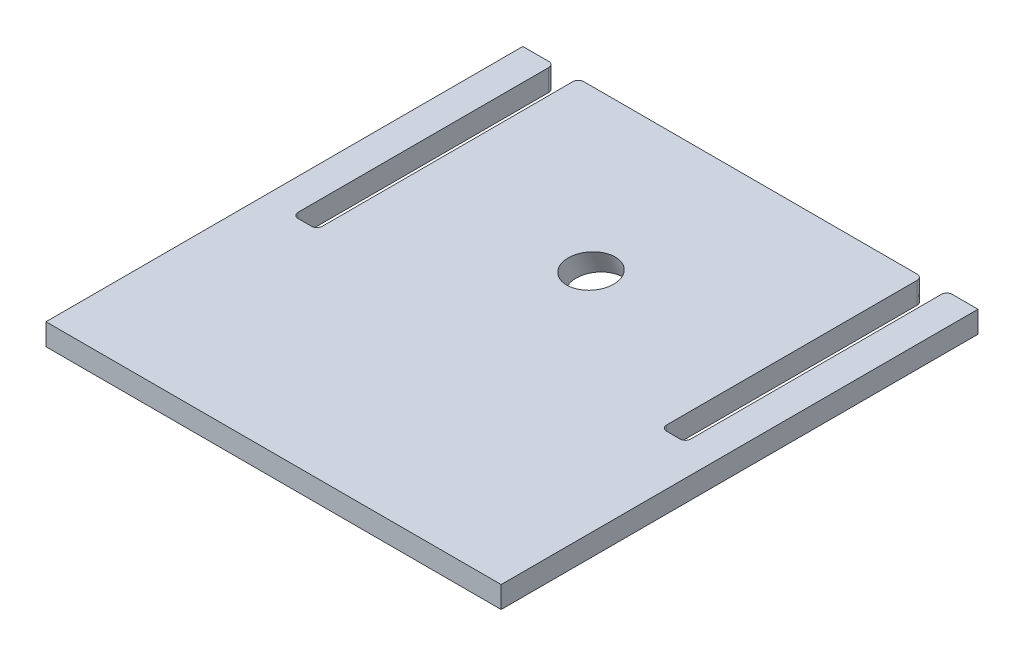
ISO-10303-21;
HEADER;
FILE_DESCRIPTION(('STEP AP214'),'2;1');
FILE_NAME('part.step','',(''),(''),'','','');
FILE_SCHEMA(('AUTOMOTIVE_DESIGN { 1 0 10303 214 1 1 1 1 }'));
ENDSEC;
DATA;
#1=APPLICATION_CONTEXT('core data for automotive mechanical design processes');
#2=APPLICATION_PROTOCOL_DEFINITION('international standard','automotive_design',2000,#1);
#3=PRODUCT_CONTEXT('',#1,'mechanical');
#4=PRODUCT('Part','Part','',(#3));
#5=PRODUCT_RELATED_PRODUCT_CATEGORY('part','',(#4));
#6=PRODUCT_DEFINITION_FORMATION('','',#4);
#7=PRODUCT_DEFINITION_CONTEXT('part definition',#1,'design');
#8=PRODUCT_DEFINITION('design','',#6,#7);
#9=PRODUCT_DEFINITION_SHAPE('','',#8);
#10=(LENGTH_UNIT() NAMED_UNIT(*) SI_UNIT(.MILLI.,.METRE.));
#11=(NAMED_UNIT(*) PLANE_ANGLE_UNIT() SI_UNIT($,.RADIAN.));
#12=(NAMED_UNIT(*) SI_UNIT($,.STERADIAN.) SOLID_ANGLE_UNIT());
#13=UNCERTAINTY_MEASURE_WITH_UNIT(LENGTH_MEASURE(1.E-05),#10,'distance_accuracy_value','');
#14=(GEOMETRIC_REPRESENTATION_CONTEXT(3) GLOBAL_UNCERTAINTY_ASSIGNED_CONTEXT((#13)) GLOBAL_UNIT_ASSIGNED_CONTEXT((#10,
#11,#12)) REPRESENTATION_CONTEXT('',''));
#15=CARTESIAN_POINT('',(0.,0.,0.));
#16=DIRECTION('',(0.,0.,1.));
#17=DIRECTION('',(1.,0.,0.));
#18=AXIS2_PLACEMENT_3D('',#15,#16,#17);
#19=CARTESIAN_POINT('',(-165.1,6.35,-139.7));
#20=DIRECTION('',(0.,0.,1.));
#21=DIRECTION('',(1.,0.,0.));
#22=AXIS2_PLACEMENT_3D('',#19,#20,#21);
#23=PLANE('',#22);
#24=DIRECTION('',(-1.,0.,0.));
#25=VECTOR('',#24,1.);
#26=CARTESIAN_POINT('',(-165.1,6.35,-139.7));
#27=LINE('',#26,#25);
#28=CARTESIAN_POINT('',(-118.237,6.35,-139.7));
#29=VERTEX_POINT('',#28);
#30=CARTESIAN_POINT('',(-133.35,6.35,-139.7));
#31=VERTEX_POINT('',#30);
#32=EDGE_CURVE('E408',#29,#31,#27,.T.);
#33=ORIENTED_EDGE('',*,*,#32,.F.);
#34=DIRECTION('',(0.,1.,0.));
#35=VECTOR('',#34,1.);
#36=CARTESIAN_POINT('',(-118.237,6.35,-139.7));
#37=LINE('',#36,#35);
#38=CARTESIAN_POINT('',(-118.237,-6.35,-139.7));
#39=VERTEX_POINT('',#38);
#40=EDGE_CURVE('E190',#29,#39,#37,.F.);
#41=ORIENTED_EDGE('',*,*,#40,.T.);
#42=DIRECTION('',(-1.,0.,0.));
#43=VECTOR('',#42,1.);
#44=CARTESIAN_POINT('',(-165.1,-6.35,-139.7));
#45=LINE('',#44,#43);
#46=CARTESIAN_POINT('',(-133.35,-6.35,-139.7));
#47=VERTEX_POINT('',#46);
#48=EDGE_CURVE('E185',#39,#47,#45,.T.);
#49=ORIENTED_EDGE('',*,*,#48,.T.);
#50=DIRECTION('',(0.,1.,0.));
#51=VECTOR('',#50,1.);
#52=CARTESIAN_POINT('',(-133.35,-6.35,-139.7));
#53=LINE('',#52,#51);
#54=EDGE_CURVE('E188',#47,#31,#53,.T.);
#55=ORIENTED_EDGE('',*,*,#54,.T.);
#56=EDGE_LOOP('',(#33,#41,#49,#55));
#57=FACE_BOUND('',#56,.T.);
#58=ADVANCED_FACE('F45',(#57),#23,.F.);
#59=CARTESIAN_POINT('',(133.35,-6.35,-139.7));
#60=VERTEX_POINT('',#59);
#61=CARTESIAN_POINT('',(118.237,-6.35,-139.7));
#62=VERTEX_POINT('',#61);
#63=EDGE_CURVE('E195',#60,#62,#45,.T.);
#64=ORIENTED_EDGE('',*,*,#63,.T.);
#65=DIRECTION('',(0.,1.,0.));
#66=VECTOR('',#65,1.);
#67=CARTESIAN_POINT('',(118.237,6.35,-139.7));
#68=LINE('',#67,#66);
#69=CARTESIAN_POINT('',(118.237,6.35,-139.7));
#70=VERTEX_POINT('',#69);
#71=EDGE_CURVE('E326',#62,#70,#68,.T.);
#72=ORIENTED_EDGE('',*,*,#71,.T.);
#73=CARTESIAN_POINT('',(133.35,6.35,-139.7));
#74=VERTEX_POINT('',#73);
#75=EDGE_CURVE('E407',#74,#70,#27,.T.);
#76=ORIENTED_EDGE('',*,*,#75,.F.);
#77=DIRECTION('',(0.,1.,0.));
#78=VECTOR('',#77,1.);
#79=CARTESIAN_POINT('',(133.35,-6.35,-139.7));
#80=LINE('',#79,#78);
#81=EDGE_CURVE('E416',#60,#74,#80,.T.);
#82=ORIENTED_EDGE('',*,*,#81,.F.);
#83=EDGE_LOOP('',(#64,#72,#76,#82));
#84=FACE_BOUND('',#83,.T.);
#85=ADVANCED_FACE('F433',(#84),#23,.F.);
#86=CARTESIAN_POINT('',(97.663,-6.35,-139.7));
#87=VERTEX_POINT('',#86);
#88=CARTESIAN_POINT('',(-97.663,-6.35,-139.7));
#89=VERTEX_POINT('',#88);
#90=EDGE_CURVE('E196',#87,#89,#45,.T.);
#91=ORIENTED_EDGE('',*,*,#90,.T.);
#92=DIRECTION('',(0.,1.,0.));
#93=VECTOR('',#92,1.);
#94=CARTESIAN_POINT('',(-97.663,6.35,-139.7));
#95=LINE('',#94,#93);
#96=CARTESIAN_POINT('',(-97.663,6.35,-139.7));
#97=VERTEX_POINT('',#96);
#98=EDGE_CURVE('E308',#89,#97,#95,.T.);
#99=ORIENTED_EDGE('',*,*,#98,.T.);
#100=CARTESIAN_POINT('',(97.663,6.35,-139.7));
#101=VERTEX_POINT('',#100);
#102=EDGE_CURVE('E221',#101,#97,#27,.T.);
#103=ORIENTED_EDGE('',*,*,#102,.F.);
#104=DIRECTION('',(0.,1.,0.));
#105=VECTOR('',#104,1.);
#106=CARTESIAN_POINT('',(97.663,6.35,-139.7));
#107=LINE('',#106,#105);
#108=EDGE_CURVE('E305',#101,#87,#107,.F.);
#109=ORIENTED_EDGE('',*,*,#108,.T.);
#110=EDGE_LOOP('',(#91,#99,#103,#109));
#111=FACE_BOUND('',#110,.T.);
#112=ADVANCED_FACE('F393',(#111),#23,.F.);
#113=CARTESIAN_POINT('',(-165.1,6.35,139.7));
#114=DIRECTION('',(0.,0.,-1.));
#115=DIRECTION('',(-1.,0.,0.));
#116=AXIS2_PLACEMENT_3D('',#113,#114,#115);
#117=PLANE('',#116);
#118=DIRECTION('',(1.,0.,0.));
#119=VECTOR('',#118,1.);
#120=CARTESIAN_POINT('',(-165.1,6.35,139.7));
#121=LINE('',#120,#119);
#122=CARTESIAN_POINT('',(-133.35,6.35,139.7));
#123=VERTEX_POINT('',#122);
#124=CARTESIAN_POINT('',(133.35,6.35,139.7));
#125=VERTEX_POINT('',#124);
#126=EDGE_CURVE('E403',#123,#125,#121,.T.);
#127=ORIENTED_EDGE('',*,*,#126,.F.);
#128=DIRECTION('',(0.,1.,0.));
#129=VECTOR('',#128,1.);
#130=CARTESIAN_POINT('',(-133.35,-6.35,139.7));
#131=LINE('',#130,#129);
#132=CARTESIAN_POINT('',(-133.35,-6.35,139.7));
#133=VERTEX_POINT('',#132);
#134=EDGE_CURVE('E273',#133,#123,#131,.T.);
#135=ORIENTED_EDGE('',*,*,#134,.F.);
#136=DIRECTION('',(1.,0.,0.));
#137=VECTOR('',#136,1.);
#138=CARTESIAN_POINT('',(-165.1,-6.35,139.7));
#139=LINE('',#138,#137);
#140=CARTESIAN_POINT('',(133.35,-6.35,139.7));
#141=VERTEX_POINT('',#140);
#142=EDGE_CURVE('E210',#133,#141,#139,.T.);
#143=ORIENTED_EDGE('',*,*,#142,.T.);
#144=DIRECTION('',(0.,1.,0.));
#145=VECTOR('',#144,1.);
#146=CARTESIAN_POINT('',(133.35,-6.35,139.7));
#147=LINE('',#146,#145);
#148=EDGE_CURVE('E400',#141,#125,#147,.T.);
#149=ORIENTED_EDGE('',*,*,#148,.T.);
#150=EDGE_LOOP('',(#127,#135,#143,#149));
#151=FACE_BOUND('',#150,.T.);
#152=ADVANCED_FACE('F427',(#151),#117,.F.);
#153=CARTESIAN_POINT('',(0.,6.35,0.));
#154=DIRECTION('',(0.,-1.,0.));
#155=DIRECTION('',(0.,0.,-1.));
#156=AXIS2_PLACEMENT_3D('',#153,#154,#155);
#157=PLANE('',#156);
#158=CARTESIAN_POINT('',(0.577885440567185,6.35,-45.6972730911315));
#159=DIRECTION('',(0.,-1.,0.));
#160=DIRECTION('',(-0.0211224465515139,0.,-0.999776896238195));
#161=AXIS2_PLACEMENT_3D('',#158,#159,#160);
#162=ELLIPSE('',#161,14.2470282966305,13.335);
#163=CARTESIAN_POINT('',(0.2769533468537,6.35,-59.9411228221545));
#164=VERTEX_POINT('',#163);
#165=EDGE_CURVE('E268',#164,#164,#162,.F.);
#166=ORIENTED_EDGE('',*,*,#165,.F.);
#167=EDGE_LOOP('',(#166));
#168=FACE_BOUND('',#167,.T.);
#169=DIRECTION('',(0.,0.,1.));
#170=VECTOR('',#169,1.);
#171=CARTESIAN_POINT('',(-115.062,6.35,-139.7));
#172=LINE('',#171,#170);
#173=CARTESIAN_POINT('',(-115.062,6.35,-136.525));
#174=VERTEX_POINT('',#173);
#175=CARTESIAN_POINT('',(-115.062,6.35,10.287));
#176=VERTEX_POINT('',#175);
#177=EDGE_CURVE('E231',#174,#176,#172,.T.);
#178=ORIENTED_EDGE('',*,*,#177,.F.);
#179=CARTESIAN_POINT('',(-118.237,6.35,-136.525));
#180=DIRECTION('',(0.,-1.,0.));
#181=DIRECTION('',(0.,0.,-1.));
#182=AXIS2_PLACEMENT_3D('',#179,#180,#181);
#183=CIRCLE('',#182,3.175);
#184=EDGE_CURVE('E289',#174,#29,#183,.F.);
#185=ORIENTED_EDGE('',*,*,#184,.T.);
#186=ORIENTED_EDGE('',*,*,#32,.T.);
#187=DIRECTION('',(0.,0.,-1.));
#188=VECTOR('',#187,1.);
#189=CARTESIAN_POINT('',(-133.35,6.35,-139.7));
#190=LINE('',#189,#188);
#191=EDGE_CURVE('E203',#123,#31,#190,.T.);
#192=ORIENTED_EDGE('',*,*,#191,.F.);
#193=ORIENTED_EDGE('',*,*,#126,.T.);
#194=DIRECTION('',(0.,0.,1.));
#195=VECTOR('',#194,1.);
#196=CARTESIAN_POINT('',(133.35,6.35,-139.7));
#197=LINE('',#196,#195);
#198=EDGE_CURVE('E229',#74,#125,#197,.T.);
#199=ORIENTED_EDGE('',*,*,#198,.F.);
#200=ORIENTED_EDGE('',*,*,#75,.T.);
#201=CARTESIAN_POINT('',(118.237,6.35,-136.525));
#202=DIRECTION('',(0.,-1.,0.));
#203=DIRECTION('',(0.,0.,-1.));
#204=AXIS2_PLACEMENT_3D('',#201,#202,#203);
#205=CIRCLE('',#204,3.175);
#206=CARTESIAN_POINT('',(115.062,6.35,-136.525));
#207=VERTEX_POINT('',#206);
#208=EDGE_CURVE('E280',#70,#207,#205,.F.);
#209=ORIENTED_EDGE('',*,*,#208,.T.);
#210=DIRECTION('',(0.,0.,-1.));
#211=VECTOR('',#210,1.);
#212=CARTESIAN_POINT('',(115.062,6.35,-139.7));
#213=LINE('',#212,#211);
#214=CARTESIAN_POINT('',(115.062,6.35,10.287));
#215=VERTEX_POINT('',#214);
#216=EDGE_CURVE('E251',#215,#207,#213,.T.);
#217=ORIENTED_EDGE('',*,*,#216,.F.);
#218=CARTESIAN_POINT('',(111.887,6.35,10.287));
#219=DIRECTION('',(0.,-1.,0.));
#220=DIRECTION('',(0.,0.,-1.));
#221=AXIS2_PLACEMENT_3D('',#218,#219,#220);
#222=CIRCLE('',#221,3.175);
#223=CARTESIAN_POINT('',(111.887,6.35,13.462));
#224=VERTEX_POINT('',#223);
#225=EDGE_CURVE('E362',#215,#224,#222,.T.);
#226=ORIENTED_EDGE('',*,*,#225,.T.);
#227=DIRECTION('',(1.,0.,0.));
#228=VECTOR('',#227,1.);
#229=CARTESIAN_POINT('',(114.3,6.35,13.462));
#230=LINE('',#229,#228);
#231=CARTESIAN_POINT('',(104.013,6.35,13.462));
#232=VERTEX_POINT('',#231);
#233=EDGE_CURVE('E247',#232,#224,#230,.T.);
#234=ORIENTED_EDGE('',*,*,#233,.F.);
#235=CARTESIAN_POINT('',(104.013,6.35,10.287));
#236=DIRECTION('',(0.,-1.,0.));
#237=DIRECTION('',(0.,0.,-1.));
#238=AXIS2_PLACEMENT_3D('',#235,#236,#237);
#239=CIRCLE('',#238,3.175);
#240=CARTESIAN_POINT('',(100.838,6.35,10.287));
#241=VERTEX_POINT('',#240);
#242=EDGE_CURVE('E350',#232,#241,#239,.T.);
#243=ORIENTED_EDGE('',*,*,#242,.T.);
#244=DIRECTION('',(0.,0.,1.));
#245=VECTOR('',#244,1.);
#246=CARTESIAN_POINT('',(100.838,6.35,-139.7));
#247=LINE('',#246,#245);
#248=CARTESIAN_POINT('',(100.838,6.35,-136.525));
#249=VERTEX_POINT('',#248);
#250=EDGE_CURVE('E234',#249,#241,#247,.T.);
#251=ORIENTED_EDGE('',*,*,#250,.F.);
#252=CARTESIAN_POINT('',(97.663,6.35,-136.525));
#253=DIRECTION('',(0.,-1.,0.));
#254=DIRECTION('',(0.,0.,-1.));
#255=AXIS2_PLACEMENT_3D('',#252,#253,#254);
#256=CIRCLE('',#255,3.175);
#257=EDGE_CURVE('E283',#249,#101,#256,.F.);
#258=ORIENTED_EDGE('',*,*,#257,.T.);
#259=ORIENTED_EDGE('',*,*,#102,.T.);
#260=CARTESIAN_POINT('',(-97.663,6.35,-136.525));
#261=DIRECTION('',(0.,-1.,0.));
#262=DIRECTION('',(0.,0.,-1.));
#263=AXIS2_PLACEMENT_3D('',#260,#261,#262);
#264=CIRCLE('',#263,3.175);
#265=CARTESIAN_POINT('',(-100.838,6.35,-136.525));
#266=VERTEX_POINT('',#265);
#267=EDGE_CURVE('E286',#97,#266,#264,.F.);
#268=ORIENTED_EDGE('',*,*,#267,.T.);
#269=DIRECTION('',(0.,0.,-1.));
#270=VECTOR('',#269,1.);
#271=CARTESIAN_POINT('',(-100.838,6.35,-139.7));
#272=LINE('',#271,#270);
#273=CARTESIAN_POINT('',(-100.838,6.35,10.287));
#274=VERTEX_POINT('',#273);
#275=EDGE_CURVE('E230',#274,#266,#272,.T.);
#276=ORIENTED_EDGE('',*,*,#275,.F.);
#277=CARTESIAN_POINT('',(-104.013,6.35,10.287));
#278=DIRECTION('',(0.,-1.,0.));
#279=DIRECTION('',(0.,0.,-1.));
#280=AXIS2_PLACEMENT_3D('',#277,#278,#279);
#281=CIRCLE('',#280,3.175);
#282=CARTESIAN_POINT('',(-104.013,6.35,13.462));
#283=VERTEX_POINT('',#282);
#284=EDGE_CURVE('E54',#274,#283,#281,.T.);
#285=ORIENTED_EDGE('',*,*,#284,.T.);
#286=DIRECTION('',(1.,0.,0.));
#287=VECTOR('',#286,1.);
#288=CARTESIAN_POINT('',(-114.3,6.35,13.462));
#289=LINE('',#288,#287);
#290=CARTESIAN_POINT('',(-111.887,6.35,13.462));
#291=VERTEX_POINT('',#290);
#292=EDGE_CURVE('E225',#291,#283,#289,.T.);
#293=ORIENTED_EDGE('',*,*,#292,.F.);
#294=CARTESIAN_POINT('',(-111.887,6.35,10.287));
#295=DIRECTION('',(0.,-1.,0.));
#296=DIRECTION('',(0.,0.,-1.));
#297=AXIS2_PLACEMENT_3D('',#294,#295,#296);
#298=CIRCLE('',#297,3.175);
#299=EDGE_CURVE('E356',#291,#176,#298,.T.);
#300=ORIENTED_EDGE('',*,*,#299,.T.);
#301=EDGE_LOOP('',(#178,#185,#186,#192,#193,#199,#200,#209,#217,#226,#234,#243,#251,#258,#259,
#268,#276,#285,#293,#300));
#302=FACE_BOUND('',#301,.T.);
#303=ADVANCED_FACE('F372',(#168,#302),#157,.F.);
#304=CARTESIAN_POINT('',(0.,-6.35,0.));
#305=DIRECTION('',(0.,-1.,0.));
#306=DIRECTION('',(0.,0.,-1.));
#307=AXIS2_PLACEMENT_3D('',#304,#305,#306);
#308=PLANE('',#307);
#309=CARTESIAN_POINT('',(0.476989852232747,-6.35,-50.4729072916073));
#310=DIRECTION('',(0.,-1.,0.));
#311=DIRECTION('',(-0.0211224465515139,0.,-0.999776896238195));
#312=AXIS2_PLACEMENT_3D('',#309,#310,#311);
#313=ELLIPSE('',#312,14.2470282966305,13.335);
#314=CARTESIAN_POINT('',(0.176057758519262,-6.35,-64.7167570226303));
#315=VERTEX_POINT('',#314);
#316=EDGE_CURVE('E213',#315,#315,#313,.F.);
#317=ORIENTED_EDGE('',*,*,#316,.T.);
#318=EDGE_LOOP('',(#317));
#319=FACE_BOUND('',#318,.T.);
#320=ORIENTED_EDGE('',*,*,#48,.F.);
#321=CARTESIAN_POINT('',(-118.237,-6.35,-136.525));
#322=DIRECTION('',(0.,-1.,0.));
#323=DIRECTION('',(0.,0.,-1.));
#324=AXIS2_PLACEMENT_3D('',#321,#322,#323);
#325=CIRCLE('',#324,3.175);
#326=CARTESIAN_POINT('',(-115.062,-6.35,-136.525));
#327=VERTEX_POINT('',#326);
#328=EDGE_CURVE('E302',#39,#327,#325,.T.);
#329=ORIENTED_EDGE('',*,*,#328,.T.);
#330=DIRECTION('',(0.,0.,1.));
#331=VECTOR('',#330,1.);
#332=CARTESIAN_POINT('',(-115.062,-6.35,-139.7));
#333=LINE('',#332,#331);
#334=CARTESIAN_POINT('',(-115.062,-6.35,10.287));
#335=VERTEX_POINT('',#334);
#336=EDGE_CURVE('E212',#327,#335,#333,.T.);
#337=ORIENTED_EDGE('',*,*,#336,.T.);
#338=CARTESIAN_POINT('',(-111.887,-6.35,10.287));
#339=DIRECTION('',(0.,-1.,0.));
#340=DIRECTION('',(0.,0.,-1.));
#341=AXIS2_PLACEMENT_3D('',#338,#339,#340);
#342=CIRCLE('',#341,3.175);
#343=CARTESIAN_POINT('',(-111.887,-6.35,13.462));
#344=VERTEX_POINT('',#343);
#345=EDGE_CURVE('E359',#335,#344,#342,.F.);
#346=ORIENTED_EDGE('',*,*,#345,.T.);
#347=DIRECTION('',(1.,0.,0.));
#348=VECTOR('',#347,1.);
#349=CARTESIAN_POINT('',(-114.3,-6.35,13.462));
#350=LINE('',#349,#348);
#351=CARTESIAN_POINT('',(-104.013,-6.35,13.462));
#352=VERTEX_POINT('',#351);
#353=EDGE_CURVE('E218',#344,#352,#350,.T.);
#354=ORIENTED_EDGE('',*,*,#353,.T.);
#355=CARTESIAN_POINT('',(-104.013,-6.35,10.287));
#356=DIRECTION('',(0.,-1.,0.));
#357=DIRECTION('',(0.,0.,-1.));
#358=AXIS2_PLACEMENT_3D('',#355,#356,#357);
#359=CIRCLE('',#358,3.175);
#360=CARTESIAN_POINT('',(-100.838,-6.35,10.287));
#361=VERTEX_POINT('',#360);
#362=EDGE_CURVE('E12',#352,#361,#359,.F.);
#363=ORIENTED_EDGE('',*,*,#362,.T.);
#364=DIRECTION('',(0.,0.,-1.));
#365=VECTOR('',#364,1.);
#366=CARTESIAN_POINT('',(-100.838,-6.35,-139.7));
#367=LINE('',#366,#365);
#368=CARTESIAN_POINT('',(-100.838,-6.35,-136.525));
#369=VERTEX_POINT('',#368);
#370=EDGE_CURVE('E239',#361,#369,#367,.T.);
#371=ORIENTED_EDGE('',*,*,#370,.T.);
#372=CARTESIAN_POINT('',(-97.663,-6.35,-136.525));
#373=DIRECTION('',(0.,-1.,0.));
#374=DIRECTION('',(0.,0.,-1.));
#375=AXIS2_PLACEMENT_3D('',#372,#373,#374);
#376=CIRCLE('',#375,3.175);
#377=EDGE_CURVE('E299',#369,#89,#376,.T.);
#378=ORIENTED_EDGE('',*,*,#377,.T.);
#379=ORIENTED_EDGE('',*,*,#90,.F.);
#380=CARTESIAN_POINT('',(97.663,-6.35,-136.525));
#381=DIRECTION('',(0.,-1.,0.));
#382=DIRECTION('',(0.,0.,-1.));
#383=AXIS2_PLACEMENT_3D('',#380,#381,#382);
#384=CIRCLE('',#383,3.175);
#385=CARTESIAN_POINT('',(100.838,-6.35,-136.525));
#386=VERTEX_POINT('',#385);
#387=EDGE_CURVE('E296',#87,#386,#384,.T.);
#388=ORIENTED_EDGE('',*,*,#387,.T.);
#389=DIRECTION('',(0.,0.,1.));
#390=VECTOR('',#389,1.);
#391=CARTESIAN_POINT('',(100.838,-6.35,-139.7));
#392=LINE('',#391,#390);
#393=CARTESIAN_POINT('',(100.838,-6.35,10.287));
#394=VERTEX_POINT('',#393);
#395=EDGE_CURVE('E243',#386,#394,#392,.T.);
#396=ORIENTED_EDGE('',*,*,#395,.T.);
#397=CARTESIAN_POINT('',(104.013,-6.35,10.287));
#398=DIRECTION('',(0.,-1.,0.));
#399=DIRECTION('',(0.,0.,-1.));
#400=AXIS2_PLACEMENT_3D('',#397,#398,#399);
#401=CIRCLE('',#400,3.175);
#402=CARTESIAN_POINT('',(104.013,-6.35,13.462));
#403=VERTEX_POINT('',#402);
#404=EDGE_CURVE('E353',#394,#403,#401,.F.);
#405=ORIENTED_EDGE('',*,*,#404,.T.);
#406=DIRECTION('',(1.,0.,0.));
#407=VECTOR('',#406,1.);
#408=CARTESIAN_POINT('',(114.3,-6.35,13.462));
#409=LINE('',#408,#407);
#410=CARTESIAN_POINT('',(111.887,-6.35,13.462));
#411=VERTEX_POINT('',#410);
#412=EDGE_CURVE('E258',#403,#411,#409,.T.);
#413=ORIENTED_EDGE('',*,*,#412,.T.);
#414=CARTESIAN_POINT('',(111.887,-6.35,10.287));
#415=DIRECTION('',(0.,-1.,0.));
#416=DIRECTION('',(0.,0.,-1.));
#417=AXIS2_PLACEMENT_3D('',#414,#415,#416);
#418=CIRCLE('',#417,3.175);
#419=CARTESIAN_POINT('',(115.062,-6.35,10.287));
#420=VERTEX_POINT('',#419);
#421=EDGE_CURVE('E365',#411,#420,#418,.F.);
#422=ORIENTED_EDGE('',*,*,#421,.T.);
#423=DIRECTION('',(0.,0.,-1.));
#424=VECTOR('',#423,1.);
#425=CARTESIAN_POINT('',(115.062,-6.35,-139.7));
#426=LINE('',#425,#424);
#427=CARTESIAN_POINT('',(115.062,-6.35,-136.525));
#428=VERTEX_POINT('',#427);
#429=EDGE_CURVE('E262',#420,#428,#426,.T.);
#430=ORIENTED_EDGE('',*,*,#429,.T.);
#431=CARTESIAN_POINT('',(118.237,-6.35,-136.525));
#432=DIRECTION('',(0.,-1.,0.));
#433=DIRECTION('',(0.,0.,-1.));
#434=AXIS2_PLACEMENT_3D('',#431,#432,#433);
#435=CIRCLE('',#434,3.175);
#436=EDGE_CURVE('E61',#428,#62,#435,.T.);
#437=ORIENTED_EDGE('',*,*,#436,.T.);
#438=ORIENTED_EDGE('',*,*,#63,.F.);
#439=DIRECTION('',(0.,0.,1.));
#440=VECTOR('',#439,1.);
#441=CARTESIAN_POINT('',(133.35,-6.35,-139.7));
#442=LINE('',#441,#440);
#443=EDGE_CURVE('E265',#60,#141,#442,.T.);
#444=ORIENTED_EDGE('',*,*,#443,.T.);
#445=ORIENTED_EDGE('',*,*,#142,.F.);
#446=DIRECTION('',(0.,0.,-1.));
#447=VECTOR('',#446,1.);
#448=CARTESIAN_POINT('',(-133.35,-6.35,-139.7));
#449=LINE('',#448,#447);
#450=EDGE_CURVE('E200',#133,#47,#449,.T.);
#451=ORIENTED_EDGE('',*,*,#450,.T.);
#452=EDGE_LOOP('',(#320,#329,#337,#346,#354,#363,#371,#378,#379,#388,#396,#405,#413,#422,#430,
#437,#438,#444,#445,#451));
#453=FACE_BOUND('',#452,.T.);
#454=ADVANCED_FACE('F207',(#319,#453),#308,.T.);
#455=CARTESIAN_POINT('',(115.062,-6.35,-139.7));
#456=DIRECTION('',(1.,0.,0.));
#457=DIRECTION('',(0.,0.,-1.));
#458=AXIS2_PLACEMENT_3D('',#455,#456,#457);
#459=PLANE('',#458);
#460=ORIENTED_EDGE('',*,*,#216,.T.);
#461=DIRECTION('',(0.,1.,0.));
#462=VECTOR('',#461,1.);
#463=CARTESIAN_POINT('',(115.062,-6.35,-136.525));
#464=LINE('',#463,#462);
#465=EDGE_CURVE('E69',#207,#428,#464,.F.);
#466=ORIENTED_EDGE('',*,*,#465,.T.);
#467=ORIENTED_EDGE('',*,*,#429,.F.);
#468=DIRECTION('',(0.,1.,0.));
#469=VECTOR('',#468,1.);
#470=CARTESIAN_POINT('',(115.062,6.35,10.287));
#471=LINE('',#470,#469);
#472=EDGE_CURVE('E330',#420,#215,#471,.T.);
#473=ORIENTED_EDGE('',*,*,#472,.T.);
#474=EDGE_LOOP('',(#460,#466,#467,#473));
#475=FACE_BOUND('',#474,.T.);
#476=ADVANCED_FACE('F438',(#475),#459,.F.);
#477=CARTESIAN_POINT('',(114.3,-6.35,13.462));
#478=DIRECTION('',(0.,0.,1.));
#479=DIRECTION('',(1.,0.,0.));
#480=AXIS2_PLACEMENT_3D('',#477,#478,#479);
#481=PLANE('',#480);
#482=ORIENTED_EDGE('',*,*,#412,.F.);
#483=DIRECTION('',(0.,1.,0.));
#484=VECTOR('',#483,1.);
#485=CARTESIAN_POINT('',(104.013,6.35,13.462));
#486=LINE('',#485,#484);
#487=EDGE_CURVE('E339',#403,#232,#486,.T.);
#488=ORIENTED_EDGE('',*,*,#487,.T.);
#489=ORIENTED_EDGE('',*,*,#233,.T.);
#490=DIRECTION('',(0.,1.,0.));
#491=VECTOR('',#490,1.);
#492=CARTESIAN_POINT('',(111.887,-6.35,13.462));
#493=LINE('',#492,#491);
#494=EDGE_CURVE('E336',#224,#411,#493,.F.);
#495=ORIENTED_EDGE('',*,*,#494,.T.);
#496=EDGE_LOOP('',(#482,#488,#489,#495));
#497=FACE_BOUND('',#496,.T.);
#498=ADVANCED_FACE('F447',(#497),#481,.F.);
#499=CARTESIAN_POINT('',(100.838,-6.35,-139.7));
#500=DIRECTION('',(-1.,0.,0.));
#501=DIRECTION('',(0.,0.,1.));
#502=AXIS2_PLACEMENT_3D('',#499,#500,#501);
#503=PLANE('',#502);
#504=ORIENTED_EDGE('',*,*,#395,.F.);
#505=DIRECTION('',(0.,1.,0.));
#506=VECTOR('',#505,1.);
#507=CARTESIAN_POINT('',(100.838,-6.35,-136.525));
#508=LINE('',#507,#506);
#509=EDGE_CURVE('E322',#386,#249,#508,.T.);
#510=ORIENTED_EDGE('',*,*,#509,.T.);
#511=ORIENTED_EDGE('',*,*,#250,.T.);
#512=DIRECTION('',(0.,1.,0.));
#513=VECTOR('',#512,1.);
#514=CARTESIAN_POINT('',(100.838,-6.35,10.287));
#515=LINE('',#514,#513);
#516=EDGE_CURVE('E319',#241,#394,#515,.F.);
#517=ORIENTED_EDGE('',*,*,#516,.T.);
#518=EDGE_LOOP('',(#504,#510,#511,#517));
#519=FACE_BOUND('',#518,.T.);
#520=ADVANCED_FACE('F456',(#519),#503,.F.);
#521=CARTESIAN_POINT('',(-115.062,-6.35,-139.7));
#522=DIRECTION('',(-1.,0.,0.));
#523=DIRECTION('',(0.,0.,1.));
#524=AXIS2_PLACEMENT_3D('',#521,#522,#523);
#525=PLANE('',#524);
#526=ORIENTED_EDGE('',*,*,#336,.F.);
#527=DIRECTION('',(0.,1.,0.));
#528=VECTOR('',#527,1.);
#529=CARTESIAN_POINT('',(-115.062,-6.35,-136.525));
#530=LINE('',#529,#528);
#531=EDGE_CURVE('E276',#327,#174,#530,.T.);
#532=ORIENTED_EDGE('',*,*,#531,.T.);
#533=ORIENTED_EDGE('',*,*,#177,.T.);
#534=DIRECTION('',(0.,1.,0.));
#535=VECTOR('',#534,1.);
#536=CARTESIAN_POINT('',(-115.062,-6.35,10.287));
#537=LINE('',#536,#535);
#538=EDGE_CURVE('E272',#176,#335,#537,.F.);
#539=ORIENTED_EDGE('',*,*,#538,.T.);
#540=EDGE_LOOP('',(#526,#532,#533,#539));
#541=FACE_BOUND('',#540,.T.);
#542=ADVANCED_FACE('F503',(#541),#525,.F.);
#543=CARTESIAN_POINT('',(-100.838,-6.35,-139.7));
#544=DIRECTION('',(1.,0.,0.));
#545=DIRECTION('',(0.,0.,-1.));
#546=AXIS2_PLACEMENT_3D('',#543,#544,#545);
#547=PLANE('',#546);
#548=ORIENTED_EDGE('',*,*,#275,.T.);
#549=DIRECTION('',(0.,1.,0.));
#550=VECTOR('',#549,1.);
#551=CARTESIAN_POINT('',(-100.838,-6.35,-136.525));
#552=LINE('',#551,#550);
#553=EDGE_CURVE('E316',#266,#369,#552,.F.);
#554=ORIENTED_EDGE('',*,*,#553,.T.);
#555=ORIENTED_EDGE('',*,*,#370,.F.);
#556=DIRECTION('',(0.,1.,0.));
#557=VECTOR('',#556,1.);
#558=CARTESIAN_POINT('',(-100.838,6.35,10.287));
#559=LINE('',#558,#557);
#560=EDGE_CURVE('E312',#361,#274,#559,.T.);
#561=ORIENTED_EDGE('',*,*,#560,.T.);
#562=EDGE_LOOP('',(#548,#554,#555,#561));
#563=FACE_BOUND('',#562,.T.);
#564=ADVANCED_FACE('F384',(#563),#547,.F.);
#565=CARTESIAN_POINT('',(-114.3,-6.35,13.462));
#566=DIRECTION('',(0.,0.,1.));
#567=DIRECTION('',(1.,0.,0.));
#568=AXIS2_PLACEMENT_3D('',#565,#566,#567);
#569=PLANE('',#568);
#570=ORIENTED_EDGE('',*,*,#353,.F.);
#571=DIRECTION('',(0.,1.,0.));
#572=VECTOR('',#571,1.);
#573=CARTESIAN_POINT('',(-111.887,6.35,13.462));
#574=LINE('',#573,#572);
#575=EDGE_CURVE('E346',#344,#291,#574,.T.);
#576=ORIENTED_EDGE('',*,*,#575,.T.);
#577=ORIENTED_EDGE('',*,*,#292,.T.);
#578=DIRECTION('',(0.,1.,0.));
#579=VECTOR('',#578,1.);
#580=CARTESIAN_POINT('',(-104.013,-6.35,13.462));
#581=LINE('',#580,#579);
#582=EDGE_CURVE('E343',#283,#352,#581,.F.);
#583=ORIENTED_EDGE('',*,*,#582,.T.);
#584=EDGE_LOOP('',(#570,#576,#577,#583));
#585=FACE_BOUND('',#584,.T.);
#586=ADVANCED_FACE('F378',(#585),#569,.F.);
#587=CARTESIAN_POINT('',(133.35,-6.35,-139.7));
#588=DIRECTION('',(-1.,0.,0.));
#589=DIRECTION('',(0.,0.,1.));
#590=AXIS2_PLACEMENT_3D('',#587,#588,#589);
#591=PLANE('',#590);
#592=ORIENTED_EDGE('',*,*,#198,.T.);
#593=ORIENTED_EDGE('',*,*,#148,.F.);
#594=ORIENTED_EDGE('',*,*,#443,.F.);
#595=ORIENTED_EDGE('',*,*,#81,.T.);
#596=EDGE_LOOP('',(#592,#593,#594,#595));
#597=FACE_BOUND('',#596,.T.);
#598=ADVANCED_FACE('F429',(#597),#591,.F.);
#599=CARTESIAN_POINT('',(-133.35,-6.35,-139.7));
#600=DIRECTION('',(1.,0.,0.));
#601=DIRECTION('',(0.,0.,-1.));
#602=AXIS2_PLACEMENT_3D('',#599,#600,#601);
#603=PLANE('',#602);
#604=ORIENTED_EDGE('',*,*,#191,.T.);
#605=ORIENTED_EDGE('',*,*,#54,.F.);
#606=ORIENTED_EDGE('',*,*,#450,.F.);
#607=ORIENTED_EDGE('',*,*,#134,.T.);
#608=EDGE_LOOP('',(#604,#605,#606,#607));
#609=FACE_BOUND('',#608,.T.);
#610=ADVANCED_FACE('F199',(#609),#603,.F.);
#611=CARTESIAN_POINT('',(0.80308394695594,34.6963437633874,-35.0380787025587));
#612=DIRECTION('',(-0.0074359624719925,-0.935984664475876,-0.351962234235575));
#613=DIRECTION('',(0.,-0.35197196525769,0.936010542500799));
#614=AXIS2_PLACEMENT_3D('',#611,#612,#613);
#615=CYLINDRICAL_SURFACE('',#614,13.335);
#616=ORIENTED_EDGE('',*,*,#316,.F.);
#617=EDGE_LOOP('',(#616));
#618=FACE_BOUND('',#617,.T.);
#619=ORIENTED_EDGE('',*,*,#165,.T.);
#620=EDGE_LOOP('',(#619));
#621=FACE_BOUND('',#620,.T.);
#622=ADVANCED_FACE('F493',(#618,#621),#615,.F.);
#623=CARTESIAN_POINT('',(-118.237,-6.35,-136.525));
#624=DIRECTION('',(0.,1.,0.));
#625=DIRECTION('',(0.,0.,1.));
#626=AXIS2_PLACEMENT_3D('',#623,#624,#625);
#627=CYLINDRICAL_SURFACE('',#626,3.175);
#628=ORIENTED_EDGE('',*,*,#328,.F.);
#629=ORIENTED_EDGE('',*,*,#40,.F.);
#630=ORIENTED_EDGE('',*,*,#184,.F.);
#631=ORIENTED_EDGE('',*,*,#531,.F.);
#632=EDGE_LOOP('',(#628,#629,#630,#631));
#633=FACE_BOUND('',#632,.T.);
#634=ADVANCED_FACE('F469',(#633),#627,.T.);
#635=CARTESIAN_POINT('',(-97.663,6.35,-136.525));
#636=DIRECTION('',(0.,1.,0.));
#637=DIRECTION('',(0.,0.,1.));
#638=AXIS2_PLACEMENT_3D('',#635,#636,#637);
#639=CYLINDRICAL_SURFACE('',#638,3.175);
#640=ORIENTED_EDGE('',*,*,#377,.F.);
#641=ORIENTED_EDGE('',*,*,#553,.F.);
#642=ORIENTED_EDGE('',*,*,#267,.F.);
#643=ORIENTED_EDGE('',*,*,#98,.F.);
#644=EDGE_LOOP('',(#640,#641,#642,#643));
#645=FACE_BOUND('',#644,.T.);
#646=ADVANCED_FACE('F387',(#645),#639,.T.);
#647=CARTESIAN_POINT('',(97.663,-6.35,-136.525));
#648=DIRECTION('',(0.,1.,0.));
#649=DIRECTION('',(0.,0.,1.));
#650=AXIS2_PLACEMENT_3D('',#647,#648,#649);
#651=CYLINDRICAL_SURFACE('',#650,3.175);
#652=ORIENTED_EDGE('',*,*,#387,.F.);
#653=ORIENTED_EDGE('',*,*,#108,.F.);
#654=ORIENTED_EDGE('',*,*,#257,.F.);
#655=ORIENTED_EDGE('',*,*,#509,.F.);
#656=EDGE_LOOP('',(#652,#653,#654,#655));
#657=FACE_BOUND('',#656,.T.);
#658=ADVANCED_FACE('F459',(#657),#651,.T.);
#659=CARTESIAN_POINT('',(118.237,6.35,-136.525));
#660=DIRECTION('',(0.,1.,0.));
#661=DIRECTION('',(0.,0.,1.));
#662=AXIS2_PLACEMENT_3D('',#659,#660,#661);
#663=CYLINDRICAL_SURFACE('',#662,3.175);
#664=ORIENTED_EDGE('',*,*,#436,.F.);
#665=ORIENTED_EDGE('',*,*,#465,.F.);
#666=ORIENTED_EDGE('',*,*,#208,.F.);
#667=ORIENTED_EDGE('',*,*,#71,.F.);
#668=EDGE_LOOP('',(#664,#665,#666,#667));
#669=FACE_BOUND('',#668,.T.);
#670=ADVANCED_FACE('F436',(#669),#663,.T.);
#671=CARTESIAN_POINT('',(104.013,-6.35,10.287));
#672=DIRECTION('',(0.,-1.,0.));
#673=DIRECTION('',(0.,0.,-1.));
#674=AXIS2_PLACEMENT_3D('',#671,#672,#673);
#675=CYLINDRICAL_SURFACE('',#674,3.175);
#676=ORIENTED_EDGE('',*,*,#404,.F.);
#677=ORIENTED_EDGE('',*,*,#516,.F.);
#678=ORIENTED_EDGE('',*,*,#242,.F.);
#679=ORIENTED_EDGE('',*,*,#487,.F.);
#680=EDGE_LOOP('',(#676,#677,#678,#679));
#681=FACE_BOUND('',#680,.T.);
#682=ADVANCED_FACE('F451',(#681),#675,.F.);
#683=CARTESIAN_POINT('',(-111.887,-6.35,10.287));
#684=DIRECTION('',(0.,-1.,0.));
#685=DIRECTION('',(0.,0.,-1.));
#686=AXIS2_PLACEMENT_3D('',#683,#684,#685);
#687=CYLINDRICAL_SURFACE('',#686,3.175);
#688=ORIENTED_EDGE('',*,*,#345,.F.);
#689=ORIENTED_EDGE('',*,*,#538,.F.);
#690=ORIENTED_EDGE('',*,*,#299,.F.);
#691=ORIENTED_EDGE('',*,*,#575,.F.);
#692=EDGE_LOOP('',(#688,#689,#690,#691));
#693=FACE_BOUND('',#692,.T.);
#694=ADVANCED_FACE('F523',(#693),#687,.F.);
#695=CARTESIAN_POINT('',(111.887,-6.35,10.287));
#696=DIRECTION('',(0.,-1.,0.));
#697=DIRECTION('',(0.,0.,-1.));
#698=AXIS2_PLACEMENT_3D('',#695,#696,#697);
#699=CYLINDRICAL_SURFACE('',#698,3.175);
#700=ORIENTED_EDGE('',*,*,#421,.F.);
#701=ORIENTED_EDGE('',*,*,#494,.F.);
#702=ORIENTED_EDGE('',*,*,#225,.F.);
#703=ORIENTED_EDGE('',*,*,#472,.F.);
#704=EDGE_LOOP('',(#700,#701,#702,#703));
#705=FACE_BOUND('',#704,.T.);
#706=ADVANCED_FACE('F442',(#705),#699,.F.);
#707=CARTESIAN_POINT('',(-104.013,-6.35,10.287));
#708=DIRECTION('',(0.,-1.,0.));
#709=DIRECTION('',(0.,0.,-1.));
#710=AXIS2_PLACEMENT_3D('',#707,#708,#709);
#711=CYLINDRICAL_SURFACE('',#710,3.175);
#712=ORIENTED_EDGE('',*,*,#362,.F.);
#713=ORIENTED_EDGE('',*,*,#582,.F.);
#714=ORIENTED_EDGE('',*,*,#284,.F.);
#715=ORIENTED_EDGE('',*,*,#560,.F.);
#716=EDGE_LOOP('',(#712,#713,#714,#715));
#717=FACE_BOUND('',#716,.T.);
#718=ADVANCED_FACE('F47',(#717),#711,.F.);
#719=CLOSED_SHELL('',(#58,#85,#112,#152,#303,#454,#476,#498,#520,#542,#564,#586,#598,#610,#622,
#634,#646,#658,#670,#682,#694,#706,#718));
#720=MANIFOLD_SOLID_BREP('B2',#719);
#721=ADVANCED_BREP_SHAPE_REPRESENTATION('',(#18,#720),#14);
#722=SHAPE_DEFINITION_REPRESENTATION(#9,#721);
ENDSEC;
END-ISO-10303-21;
